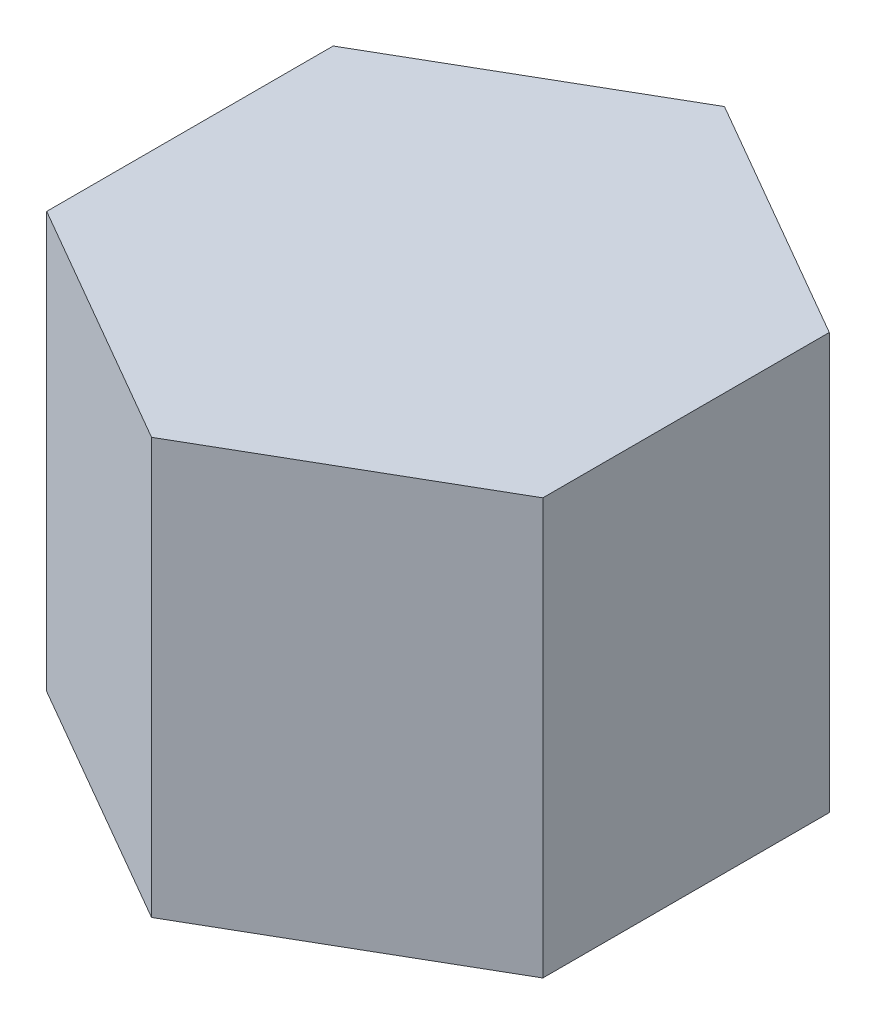
ISO-10303-21;
HEADER;
FILE_DESCRIPTION(('STEP AP214'),'2;1');
FILE_NAME('part.step','',(''),(''),'','','');
FILE_SCHEMA(('AUTOMOTIVE_DESIGN { 1 0 10303 214 1 1 1 1 }'));
ENDSEC;
DATA;
#1=APPLICATION_CONTEXT('core data for automotive mechanical design processes');
#2=APPLICATION_PROTOCOL_DEFINITION('international standard','automotive_design',2000,#1);
#3=PRODUCT_CONTEXT('',#1,'mechanical');
#4=PRODUCT('Part','Part','',(#3));
#5=PRODUCT_RELATED_PRODUCT_CATEGORY('part','',(#4));
#6=PRODUCT_DEFINITION_FORMATION('','',#4);
#7=PRODUCT_DEFINITION_CONTEXT('part definition',#1,'design');
#8=PRODUCT_DEFINITION('design','',#6,#7);
#9=PRODUCT_DEFINITION_SHAPE('','',#8);
#10=(LENGTH_UNIT() NAMED_UNIT(*) SI_UNIT(.MILLI.,.METRE.));
#11=(NAMED_UNIT(*) PLANE_ANGLE_UNIT() SI_UNIT($,.RADIAN.));
#12=(NAMED_UNIT(*) SI_UNIT($,.STERADIAN.) SOLID_ANGLE_UNIT());
#13=UNCERTAINTY_MEASURE_WITH_UNIT(LENGTH_MEASURE(1.E-05),#10,'distance_accuracy_value','');
#14=(GEOMETRIC_REPRESENTATION_CONTEXT(3) GLOBAL_UNCERTAINTY_ASSIGNED_CONTEXT((#13)) GLOBAL_UNIT_ASSIGNED_CONTEXT((#10,
#11,#12)) REPRESENTATION_CONTEXT('',''));
#15=CARTESIAN_POINT('',(0.,0.,0.));
#16=DIRECTION('',(0.,0.,1.));
#17=DIRECTION('',(1.,0.,0.));
#18=AXIS2_PLACEMENT_3D('',#15,#16,#17);
#19=CARTESIAN_POINT('',(209.142660308706,-148.537700895744,287.176844201572));
#20=DIRECTION('',(-0.499999999999943,0.,-0.866025403784472));
#21=DIRECTION('',(-0.866025403784472,0.,0.499999999999943));
#22=AXIS2_PLACEMENT_3D('',#19,#20,#21);
#23=PLANE('',#22);
#24=CARTESIAN_POINT('',(208.839551417382,-149.045793579175,287.351844201572));
#25=DIRECTION('',(0.866025403784471,0.,-0.499999999999943));
#26=VECTOR('',#25,1.);
#27=LINE('',#24,#26);
#28=CARTESIAN_POINT('',(208.839551417382,-149.045793579175,287.351844201572));
#29=VERTEX_POINT('',#28);
#30=CARTESIAN_POINT('',(209.142660308706,-149.045793579175,287.176844201572));
#31=VERTEX_POINT('',#30);
#32=EDGE_CURVE('E170',#29,#31,#27,.T.);
#33=ORIENTED_EDGE('',*,*,#32,.T.);
#34=CARTESIAN_POINT('',(209.142660308706,-148.537700895744,287.176844201572));
#35=DIRECTION('',(0.,-1.,0.));
#36=VECTOR('',#35,1.);
#37=LINE('',#34,#36);
#38=CARTESIAN_POINT('',(209.142660308706,-148.537700895744,287.176844201572));
#39=VERTEX_POINT('',#38);
#40=EDGE_CURVE('E35',#39,#31,#37,.T.);
#41=ORIENTED_EDGE('',*,*,#40,.F.);
#42=CARTESIAN_POINT('',(208.839551417382,-148.537700895744,287.351844201572));
#43=DIRECTION('',(0.866025403784471,0.,-0.499999999999943));
#44=VECTOR('',#43,1.);
#45=LINE('',#42,#44);
#46=CARTESIAN_POINT('',(208.839551417382,-148.537700895744,287.351844201572));
#47=VERTEX_POINT('',#46);
#48=EDGE_CURVE('E159',#47,#39,#45,.T.);
#49=ORIENTED_EDGE('',*,*,#48,.F.);
#50=CARTESIAN_POINT('',(208.839551417382,-148.537700895744,287.351844201572));
#51=DIRECTION('',(0.,-1.,0.));
#52=VECTOR('',#51,1.);
#53=LINE('',#50,#52);
#54=EDGE_CURVE('E10',#47,#29,#53,.T.);
#55=ORIENTED_EDGE('',*,*,#54,.T.);
#56=EDGE_LOOP('',(#33,#41,#49,#55));
#57=FACE_BOUND('',#56,.T.);
#58=ADVANCED_FACE('F16',(#57),#23,.F.);
#59=CARTESIAN_POINT('',(208.839551417382,-148.537700895744,287.351844201572));
#60=DIRECTION('',(0.499999999999943,0.,-0.866025403784472));
#61=DIRECTION('',(-0.866025403784472,0.,-0.499999999999943));
#62=AXIS2_PLACEMENT_3D('',#59,#60,#61);
#63=PLANE('',#62);
#64=CARTESIAN_POINT('',(208.536442526057,-149.045793579175,287.176844201572));
#65=DIRECTION('',(0.866025403784471,0.,0.499999999999943));
#66=VECTOR('',#65,1.);
#67=LINE('',#64,#66);
#68=CARTESIAN_POINT('',(208.536442526057,-149.045793579175,287.176844201572));
#69=VERTEX_POINT('',#68);
#70=EDGE_CURVE('E167',#69,#29,#67,.T.);
#71=ORIENTED_EDGE('',*,*,#70,.T.);
#72=ORIENTED_EDGE('',*,*,#54,.F.);
#73=CARTESIAN_POINT('',(208.536442526057,-148.537700895744,287.176844201572));
#74=DIRECTION('',(0.866025403784471,0.,0.499999999999943));
#75=VECTOR('',#74,1.);
#76=LINE('',#73,#75);
#77=CARTESIAN_POINT('',(208.536442526057,-148.537700895744,287.176844201572));
#78=VERTEX_POINT('',#77);
#79=EDGE_CURVE('E156',#78,#47,#76,.T.);
#80=ORIENTED_EDGE('',*,*,#79,.F.);
#81=CARTESIAN_POINT('',(208.536442526057,-148.537700895744,287.176844201572));
#82=DIRECTION('',(0.,-1.,0.));
#83=VECTOR('',#82,1.);
#84=LINE('',#81,#83);
#85=EDGE_CURVE('E27',#78,#69,#84,.T.);
#86=ORIENTED_EDGE('',*,*,#85,.T.);
#87=EDGE_LOOP('',(#71,#72,#80,#86));
#88=FACE_BOUND('',#87,.T.);
#89=ADVANCED_FACE('F189',(#88),#63,.F.);
#90=CARTESIAN_POINT('',(208.536442526057,-148.537700895744,290.831971220494));
#91=DIRECTION('',(1.,0.,0.));
#92=DIRECTION('',(0.,1.,0.));
#93=AXIS2_PLACEMENT_3D('',#90,#91,#92);
#94=PLANE('',#93);
#95=CARTESIAN_POINT('',(208.536442526057,-149.045793579175,286.826844201572));
#96=DIRECTION('',(0.,0.,1.));
#97=VECTOR('',#96,1.);
#98=LINE('',#95,#97);
#99=CARTESIAN_POINT('',(208.536442526057,-149.045793579175,286.826844201572));
#100=VERTEX_POINT('',#99);
#101=EDGE_CURVE('E163',#100,#69,#98,.T.);
#102=ORIENTED_EDGE('',*,*,#101,.T.);
#103=ORIENTED_EDGE('',*,*,#85,.F.);
#104=CARTESIAN_POINT('',(208.536442526057,-148.537700895744,286.826844201572));
#105=DIRECTION('',(0.,0.,1.));
#106=VECTOR('',#105,1.);
#107=LINE('',#104,#106);
#108=CARTESIAN_POINT('',(208.536442526057,-148.537700895744,286.826844201572));
#109=VERTEX_POINT('',#108);
#110=EDGE_CURVE('E106',#109,#78,#107,.T.);
#111=ORIENTED_EDGE('',*,*,#110,.F.);
#112=CARTESIAN_POINT('',(208.536442526057,-148.537700895744,286.826844201572));
#113=DIRECTION('',(0.,-1.,0.));
#114=VECTOR('',#113,1.);
#115=LINE('',#112,#114);
#116=EDGE_CURVE('E94',#109,#100,#115,.T.);
#117=ORIENTED_EDGE('',*,*,#116,.T.);
#118=EDGE_LOOP('',(#102,#103,#111,#117));
#119=FACE_BOUND('',#118,.T.);
#120=ADVANCED_FACE('F198',(#119),#94,.F.);
#121=CARTESIAN_POINT('',(208.536442526057,-148.537700895744,286.826844201572));
#122=DIRECTION('',(0.499999999999978,0.,0.866025403784452));
#123=DIRECTION('',(0.866025403784452,0.,-0.499999999999978));
#124=AXIS2_PLACEMENT_3D('',#121,#122,#123);
#125=PLANE('',#124);
#126=CARTESIAN_POINT('',(208.839551417382,-149.045793579175,286.651844201572));
#127=DIRECTION('',(-0.866025403784452,0.,0.499999999999978));
#128=VECTOR('',#127,1.);
#129=LINE('',#126,#128);
#130=CARTESIAN_POINT('',(208.839551417382,-149.045793579175,286.651844201572));
#131=VERTEX_POINT('',#130);
#132=EDGE_CURVE('E162',#131,#100,#129,.T.);
#133=ORIENTED_EDGE('',*,*,#132,.T.);
#134=ORIENTED_EDGE('',*,*,#116,.F.);
#135=CARTESIAN_POINT('',(208.839551417382,-148.537700895744,286.651844201572));
#136=DIRECTION('',(-0.866025403784452,0.,0.499999999999978));
#137=VECTOR('',#136,1.);
#138=LINE('',#135,#137);
#139=CARTESIAN_POINT('',(208.839551417382,-148.537700895744,286.651844201572));
#140=VERTEX_POINT('',#139);
#141=EDGE_CURVE('E98',#140,#109,#138,.T.);
#142=ORIENTED_EDGE('',*,*,#141,.F.);
#143=CARTESIAN_POINT('',(208.839551417382,-148.537700895744,286.651844201572));
#144=DIRECTION('',(0.,-1.,0.));
#145=VECTOR('',#144,1.);
#146=LINE('',#143,#145);
#147=EDGE_CURVE('E79',#140,#131,#146,.T.);
#148=ORIENTED_EDGE('',*,*,#147,.T.);
#149=EDGE_LOOP('',(#133,#134,#142,#148));
#150=FACE_BOUND('',#149,.T.);
#151=ADVANCED_FACE('F100',(#150),#125,.F.);
#152=CARTESIAN_POINT('',(208.839551417382,-148.537700895744,286.651844201572));
#153=DIRECTION('',(-0.499999999999943,0.,0.866025403784472));
#154=DIRECTION('',(0.866025403784472,0.,0.499999999999943));
#155=AXIS2_PLACEMENT_3D('',#152,#153,#154);
#156=PLANE('',#155);
#157=CARTESIAN_POINT('',(209.142660308706,-149.045793579175,286.826844201572));
#158=DIRECTION('',(-0.866025403784471,0.,-0.499999999999943));
#159=VECTOR('',#158,1.);
#160=LINE('',#157,#159);
#161=CARTESIAN_POINT('',(209.142660308706,-149.045793579175,286.826844201572));
#162=VERTEX_POINT('',#161);
#163=EDGE_CURVE('E88',#162,#131,#160,.T.);
#164=ORIENTED_EDGE('',*,*,#163,.T.);
#165=ORIENTED_EDGE('',*,*,#147,.F.);
#166=CARTESIAN_POINT('',(209.142660308706,-148.537700895744,286.826844201572));
#167=DIRECTION('',(-0.866025403784471,0.,-0.499999999999943));
#168=VECTOR('',#167,1.);
#169=LINE('',#166,#168);
#170=CARTESIAN_POINT('',(209.142660308706,-148.537700895744,286.826844201572));
#171=VERTEX_POINT('',#170);
#172=EDGE_CURVE('E84',#171,#140,#169,.T.);
#173=ORIENTED_EDGE('',*,*,#172,.F.);
#174=CARTESIAN_POINT('',(209.142660308706,-148.537700895744,286.826844201572));
#175=DIRECTION('',(0.,-1.,0.));
#176=VECTOR('',#175,1.);
#177=LINE('',#174,#176);
#178=EDGE_CURVE('E58',#171,#162,#177,.T.);
#179=ORIENTED_EDGE('',*,*,#178,.T.);
#180=EDGE_LOOP('',(#164,#165,#173,#179));
#181=FACE_BOUND('',#180,.T.);
#182=ADVANCED_FACE('F82',(#181),#156,.F.);
#183=CARTESIAN_POINT('',(209.142660308706,-148.537700895744,290.831971220494));
#184=DIRECTION('',(-1.,0.,0.));
#185=DIRECTION('',(0.,-1.,0.));
#186=AXIS2_PLACEMENT_3D('',#183,#184,#185);
#187=PLANE('',#186);
#188=CARTESIAN_POINT('',(209.142660308706,-149.045793579175,287.176844201572));
#189=DIRECTION('',(0.,0.,-1.));
#190=VECTOR('',#189,1.);
#191=LINE('',#188,#190);
#192=EDGE_CURVE('E160',#31,#162,#191,.T.);
#193=ORIENTED_EDGE('',*,*,#192,.T.);
#194=ORIENTED_EDGE('',*,*,#178,.F.);
#195=CARTESIAN_POINT('',(209.142660308706,-148.537700895744,287.176844201572));
#196=DIRECTION('',(0.,0.,-1.));
#197=VECTOR('',#196,1.);
#198=LINE('',#195,#197);
#199=EDGE_CURVE('E112',#39,#171,#198,.T.);
#200=ORIENTED_EDGE('',*,*,#199,.F.);
#201=ORIENTED_EDGE('',*,*,#40,.T.);
#202=EDGE_LOOP('',(#193,#194,#200,#201));
#203=FACE_BOUND('',#202,.T.);
#204=ADVANCED_FACE('F131',(#203),#187,.F.);
#205=CARTESIAN_POINT('',(206.339551417382,-148.537700895744,290.831971220494));
#206=DIRECTION('',(0.,-1.,0.));
#207=DIRECTION('',(1.,0.,0.));
#208=AXIS2_PLACEMENT_3D('',#205,#206,#207);
#209=PLANE('',#208);
#210=ORIENTED_EDGE('',*,*,#48,.T.);
#211=ORIENTED_EDGE('',*,*,#199,.T.);
#212=ORIENTED_EDGE('',*,*,#172,.T.);
#213=ORIENTED_EDGE('',*,*,#141,.T.);
#214=ORIENTED_EDGE('',*,*,#110,.T.);
#215=ORIENTED_EDGE('',*,*,#79,.T.);
#216=EDGE_LOOP('',(#210,#211,#212,#213,#214,#215));
#217=FACE_BOUND('',#216,.T.);
#218=ADVANCED_FACE('F111',(#217),#209,.F.);
#219=CARTESIAN_POINT('',(206.339551417382,-149.045793579175,290.831971220494));
#220=DIRECTION('',(0.,-1.,0.));
#221=DIRECTION('',(1.,0.,0.));
#222=AXIS2_PLACEMENT_3D('',#219,#220,#221);
#223=PLANE('',#222);
#224=ORIENTED_EDGE('',*,*,#32,.F.);
#225=ORIENTED_EDGE('',*,*,#70,.F.);
#226=ORIENTED_EDGE('',*,*,#101,.F.);
#227=ORIENTED_EDGE('',*,*,#132,.F.);
#228=ORIENTED_EDGE('',*,*,#163,.F.);
#229=ORIENTED_EDGE('',*,*,#192,.F.);
#230=EDGE_LOOP('',(#224,#225,#226,#227,#228,#229));
#231=FACE_BOUND('',#230,.T.);
#232=ADVANCED_FACE('F130',(#231),#223,.T.);
#233=CLOSED_SHELL('',(#58,#89,#120,#151,#182,#204,#218,#232));
#234=MANIFOLD_SOLID_BREP('B1',#233);
#235=ADVANCED_BREP_SHAPE_REPRESENTATION('',(#18,#234),#14);
#236=SHAPE_DEFINITION_REPRESENTATION(#9,#235);
ENDSEC;
END-ISO-10303-21;
